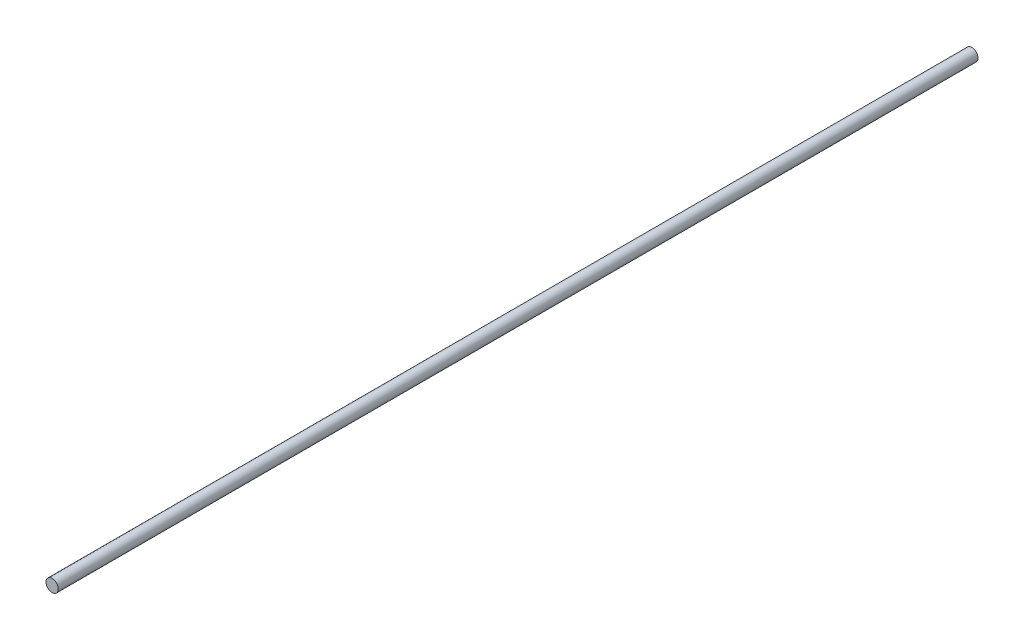
ISO-10303-21;
HEADER;
FILE_DESCRIPTION(('STEP AP214'),'2;1');
FILE_NAME('part.step','',(''),(''),'','','');
FILE_SCHEMA(('AUTOMOTIVE_DESIGN { 1 0 10303 214 1 1 1 1 }'));
ENDSEC;
DATA;
#1=APPLICATION_CONTEXT('core data for automotive mechanical design processes');
#2=APPLICATION_PROTOCOL_DEFINITION('international standard','automotive_design',2000,#1);
#3=PRODUCT_CONTEXT('',#1,'mechanical');
#4=PRODUCT('Part','Part','',(#3));
#5=PRODUCT_RELATED_PRODUCT_CATEGORY('part','',(#4));
#6=PRODUCT_DEFINITION_FORMATION('','',#4);
#7=PRODUCT_DEFINITION_CONTEXT('part definition',#1,'design');
#8=PRODUCT_DEFINITION('design','',#6,#7);
#9=PRODUCT_DEFINITION_SHAPE('','',#8);
#10=(LENGTH_UNIT() NAMED_UNIT(*) SI_UNIT(.MILLI.,.METRE.));
#11=(NAMED_UNIT(*) PLANE_ANGLE_UNIT() SI_UNIT($,.RADIAN.));
#12=(NAMED_UNIT(*) SI_UNIT($,.STERADIAN.) SOLID_ANGLE_UNIT());
#13=UNCERTAINTY_MEASURE_WITH_UNIT(LENGTH_MEASURE(1.E-05),#10,'distance_accuracy_value','');
#14=(GEOMETRIC_REPRESENTATION_CONTEXT(3) GLOBAL_UNCERTAINTY_ASSIGNED_CONTEXT((#13)) GLOBAL_UNIT_ASSIGNED_CONTEXT((#10,
#11,#12)) REPRESENTATION_CONTEXT('',''));
#15=CARTESIAN_POINT('',(0.,0.,0.));
#16=DIRECTION('',(0.,0.,1.));
#17=DIRECTION('',(1.,0.,0.));
#18=AXIS2_PLACEMENT_3D('',#15,#16,#17);
#19=CARTESIAN_POINT('',(0.,0.,600.));
#20=DIRECTION('',(0.,0.,-1.));
#21=DIRECTION('',(-1.,0.,0.));
#22=AXIS2_PLACEMENT_3D('',#19,#20,#21);
#23=CYLINDRICAL_SURFACE('',#22,4.);
#24=CARTESIAN_POINT('',(0.,0.,600.));
#25=DIRECTION('',(0.,0.,1.));
#26=DIRECTION('',(1.,0.,0.));
#27=AXIS2_PLACEMENT_3D('',#24,#25,#26);
#28=CIRCLE('',#27,4.);
#29=CARTESIAN_POINT('',(4.,0.,600.));
#30=VERTEX_POINT('',#29);
#31=EDGE_CURVE('E10',#30,#30,#28,.T.);
#32=ORIENTED_EDGE('',*,*,#31,.F.);
#33=EDGE_LOOP('',(#32));
#34=FACE_BOUND('',#33,.T.);
#35=CARTESIAN_POINT('',(0.,0.,0.));
#36=DIRECTION('',(0.,0.,1.));
#37=DIRECTION('',(1.,0.,0.));
#38=AXIS2_PLACEMENT_3D('',#35,#36,#37);
#39=CIRCLE('',#38,4.);
#40=CARTESIAN_POINT('',(4.,0.,0.));
#41=VERTEX_POINT('',#40);
#42=EDGE_CURVE('E38',#41,#41,#39,.T.);
#43=ORIENTED_EDGE('',*,*,#42,.T.);
#44=EDGE_LOOP('',(#43));
#45=FACE_BOUND('',#44,.T.);
#46=ADVANCED_FACE('F35',(#34,#45),#23,.T.);
#47=CARTESIAN_POINT('',(0.,0.,600.));
#48=DIRECTION('',(0.,0.,1.));
#49=DIRECTION('',(1.,0.,0.));
#50=AXIS2_PLACEMENT_3D('',#47,#48,#49);
#51=PLANE('',#50);
#52=ORIENTED_EDGE('',*,*,#31,.T.);
#53=EDGE_LOOP('',(#52));
#54=FACE_BOUND('',#53,.T.);
#55=ADVANCED_FACE('F50',(#54),#51,.T.);
#56=CARTESIAN_POINT('',(0.,0.,0.));
#57=DIRECTION('',(0.,0.,1.));
#58=DIRECTION('',(1.,0.,0.));
#59=AXIS2_PLACEMENT_3D('',#56,#57,#58);
#60=PLANE('',#59);
#61=ORIENTED_EDGE('',*,*,#42,.F.);
#62=EDGE_LOOP('',(#61));
#63=FACE_BOUND('',#62,.T.);
#64=ADVANCED_FACE('F48',(#63),#60,.F.);
#65=CLOSED_SHELL('',(#46,#55,#64));
#66=MANIFOLD_SOLID_BREP('B2',#65);
#67=ADVANCED_BREP_SHAPE_REPRESENTATION('',(#18,#66),#14);
#68=SHAPE_DEFINITION_REPRESENTATION(#9,#67);
ENDSEC;
END-ISO-10303-21;
